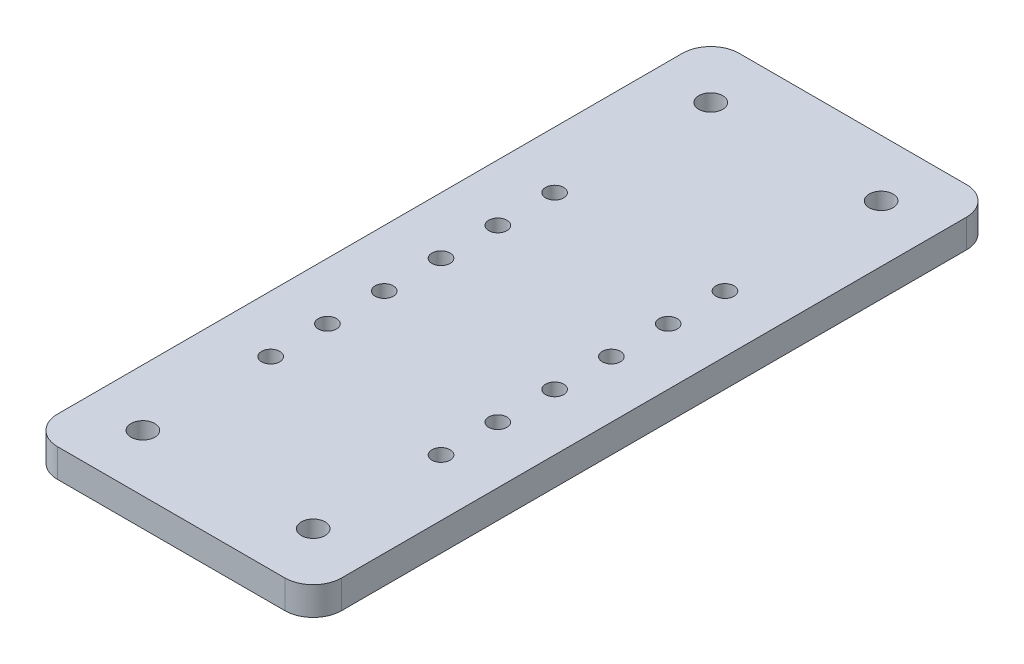
ISO-10303-21;
HEADER;
FILE_DESCRIPTION(('STEP AP214'),'2;1');
FILE_NAME('part.step','',(''),(''),'','','');
FILE_SCHEMA(('AUTOMOTIVE_DESIGN { 1 0 10303 214 1 1 1 1 }'));
ENDSEC;
DATA;
#1=APPLICATION_CONTEXT('core data for automotive mechanical design processes');
#2=APPLICATION_PROTOCOL_DEFINITION('international standard','automotive_design',2000,#1);
#3=PRODUCT_CONTEXT('',#1,'mechanical');
#4=PRODUCT('Part','Part','',(#3));
#5=PRODUCT_RELATED_PRODUCT_CATEGORY('part','',(#4));
#6=PRODUCT_DEFINITION_FORMATION('','',#4);
#7=PRODUCT_DEFINITION_CONTEXT('part definition',#1,'design');
#8=PRODUCT_DEFINITION('design','',#6,#7);
#9=PRODUCT_DEFINITION_SHAPE('','',#8);
#10=(LENGTH_UNIT() NAMED_UNIT(*) SI_UNIT(.MILLI.,.METRE.));
#11=(NAMED_UNIT(*) PLANE_ANGLE_UNIT() SI_UNIT($,.RADIAN.));
#12=(NAMED_UNIT(*) SI_UNIT($,.STERADIAN.) SOLID_ANGLE_UNIT());
#13=UNCERTAINTY_MEASURE_WITH_UNIT(LENGTH_MEASURE(1.E-05),#10,'distance_accuracy_value','');
#14=(GEOMETRIC_REPRESENTATION_CONTEXT(3) GLOBAL_UNCERTAINTY_ASSIGNED_CONTEXT((#13)) GLOBAL_UNIT_ASSIGNED_CONTEXT((#10,
#11,#12)) REPRESENTATION_CONTEXT('',''));
#15=CARTESIAN_POINT('',(0.,0.,0.));
#16=DIRECTION('',(0.,0.,1.));
#17=DIRECTION('',(1.,0.,0.));
#18=AXIS2_PLACEMENT_3D('',#15,#16,#17);
#19=CARTESIAN_POINT('',(25.,5.,0.));
#20=DIRECTION('',(1.,0.,0.));
#21=DIRECTION('',(0.,0.,-1.));
#22=AXIS2_PLACEMENT_3D('',#19,#20,#21);
#23=PLANE('',#22);
#24=DIRECTION('',(0.,0.,1.));
#25=VECTOR('',#24,1.);
#26=CARTESIAN_POINT('',(25.,5.,0.));
#27=LINE('',#26,#25);
#28=CARTESIAN_POINT('',(25.,5.,-55.));
#29=VERTEX_POINT('',#28);
#30=CARTESIAN_POINT('',(25.,5.,55.));
#31=VERTEX_POINT('',#30);
#32=EDGE_CURVE('E237',#29,#31,#27,.T.);
#33=ORIENTED_EDGE('',*,*,#32,.T.);
#34=DIRECTION('',(0.,-1.,0.));
#35=VECTOR('',#34,1.);
#36=CARTESIAN_POINT('',(25.,0.,55.));
#37=LINE('',#36,#35);
#38=CARTESIAN_POINT('',(25.,0.,55.));
#39=VERTEX_POINT('',#38);
#40=EDGE_CURVE('E230',#31,#39,#37,.T.);
#41=ORIENTED_EDGE('',*,*,#40,.T.);
#42=DIRECTION('',(0.,0.,1.));
#43=VECTOR('',#42,1.);
#44=CARTESIAN_POINT('',(25.,0.,0.));
#45=LINE('',#44,#43);
#46=CARTESIAN_POINT('',(25.,0.,-55.));
#47=VERTEX_POINT('',#46);
#48=EDGE_CURVE('E188',#47,#39,#45,.T.);
#49=ORIENTED_EDGE('',*,*,#48,.F.);
#50=DIRECTION('',(0.,-1.,0.));
#51=VECTOR('',#50,1.);
#52=CARTESIAN_POINT('',(25.,5.,-55.));
#53=LINE('',#52,#51);
#54=EDGE_CURVE('E228',#47,#29,#53,.F.);
#55=ORIENTED_EDGE('',*,*,#54,.T.);
#56=EDGE_LOOP('',(#33,#41,#49,#55));
#57=FACE_BOUND('',#56,.T.);
#58=ADVANCED_FACE('F89',(#57),#23,.T.);
#59=CARTESIAN_POINT('',(-25.,5.,0.));
#60=DIRECTION('',(1.,0.,0.));
#61=DIRECTION('',(0.,0.,-1.));
#62=AXIS2_PLACEMENT_3D('',#59,#60,#61);
#63=PLANE('',#62);
#64=DIRECTION('',(0.,0.,1.));
#65=VECTOR('',#64,1.);
#66=CARTESIAN_POINT('',(-25.,0.,0.));
#67=LINE('',#66,#65);
#68=CARTESIAN_POINT('',(-25.,0.,-55.));
#69=VERTEX_POINT('',#68);
#70=CARTESIAN_POINT('',(-25.,0.,55.));
#71=VERTEX_POINT('',#70);
#72=EDGE_CURVE('E183',#69,#71,#67,.T.);
#73=ORIENTED_EDGE('',*,*,#72,.T.);
#74=DIRECTION('',(0.,-1.,0.));
#75=VECTOR('',#74,1.);
#76=CARTESIAN_POINT('',(-25.,5.,55.));
#77=LINE('',#76,#75);
#78=CARTESIAN_POINT('',(-25.,5.,55.));
#79=VERTEX_POINT('',#78);
#80=EDGE_CURVE('E160',#71,#79,#77,.F.);
#81=ORIENTED_EDGE('',*,*,#80,.T.);
#82=DIRECTION('',(0.,0.,1.));
#83=VECTOR('',#82,1.);
#84=CARTESIAN_POINT('',(-25.,5.,0.));
#85=LINE('',#84,#83);
#86=CARTESIAN_POINT('',(-25.,5.,-55.));
#87=VERTEX_POINT('',#86);
#88=EDGE_CURVE('E283',#87,#79,#85,.T.);
#89=ORIENTED_EDGE('',*,*,#88,.F.);
#90=DIRECTION('',(0.,-1.,0.));
#91=VECTOR('',#90,1.);
#92=CARTESIAN_POINT('',(-25.,5.,-55.));
#93=LINE('',#92,#91);
#94=EDGE_CURVE('E165',#87,#69,#93,.T.);
#95=ORIENTED_EDGE('',*,*,#94,.T.);
#96=EDGE_LOOP('',(#73,#81,#89,#95));
#97=FACE_BOUND('',#96,.T.);
#98=ADVANCED_FACE('F401',(#97),#63,.F.);
#99=CARTESIAN_POINT('',(-15.,5.,50.));
#100=DIRECTION('',(0.,-1.,0.));
#101=DIRECTION('',(0.,0.,-1.));
#102=AXIS2_PLACEMENT_3D('',#99,#100,#101);
#103=CYLINDRICAL_SURFACE('',#102,2.1);
#104=CARTESIAN_POINT('',(-15.,5.,50.));
#105=DIRECTION('',(0.,1.,0.));
#106=DIRECTION('',(0.,0.,1.));
#107=AXIS2_PLACEMENT_3D('',#104,#105,#106);
#108=CIRCLE('',#107,2.1);
#109=CARTESIAN_POINT('',(-15.,5.,52.1));
#110=VERTEX_POINT('',#109);
#111=EDGE_CURVE('E279',#110,#110,#108,.T.);
#112=ORIENTED_EDGE('',*,*,#111,.T.);
#113=EDGE_LOOP('',(#112));
#114=FACE_BOUND('',#113,.T.);
#115=CARTESIAN_POINT('',(-15.,0.,50.));
#116=DIRECTION('',(0.,1.,0.));
#117=DIRECTION('',(0.,0.,1.));
#118=AXIS2_PLACEMENT_3D('',#115,#116,#117);
#119=CIRCLE('',#118,2.1);
#120=CARTESIAN_POINT('',(-15.,0.,52.1));
#121=VERTEX_POINT('',#120);
#122=EDGE_CURVE('E182',#121,#121,#119,.T.);
#123=ORIENTED_EDGE('',*,*,#122,.F.);
#124=EDGE_LOOP('',(#123));
#125=FACE_BOUND('',#124,.T.);
#126=ADVANCED_FACE('F403',(#114,#125),#103,.F.);
#127=CARTESIAN_POINT('',(0.,5.,60.));
#128=DIRECTION('',(0.,0.,-1.));
#129=DIRECTION('',(-1.,0.,0.));
#130=AXIS2_PLACEMENT_3D('',#127,#128,#129);
#131=PLANE('',#130);
#132=DIRECTION('',(1.,0.,0.));
#133=VECTOR('',#132,1.);
#134=CARTESIAN_POINT('',(0.,5.,60.));
#135=LINE('',#134,#133);
#136=CARTESIAN_POINT('',(-20.,5.,60.));
#137=VERTEX_POINT('',#136);
#138=CARTESIAN_POINT('',(20.,5.,60.));
#139=VERTEX_POINT('',#138);
#140=EDGE_CURVE('E175',#137,#139,#135,.T.);
#141=ORIENTED_EDGE('',*,*,#140,.F.);
#142=DIRECTION('',(0.,-1.,0.));
#143=VECTOR('',#142,1.);
#144=CARTESIAN_POINT('',(-20.,5.,60.));
#145=LINE('',#144,#143);
#146=CARTESIAN_POINT('',(-20.,0.,60.));
#147=VERTEX_POINT('',#146);
#148=EDGE_CURVE('E159',#137,#147,#145,.T.);
#149=ORIENTED_EDGE('',*,*,#148,.T.);
#150=DIRECTION('',(1.,0.,0.));
#151=VECTOR('',#150,1.);
#152=CARTESIAN_POINT('',(0.,0.,60.));
#153=LINE('',#152,#151);
#154=CARTESIAN_POINT('',(20.,0.,60.));
#155=VERTEX_POINT('',#154);
#156=EDGE_CURVE('E172',#147,#155,#153,.T.);
#157=ORIENTED_EDGE('',*,*,#156,.T.);
#158=DIRECTION('',(0.,-1.,0.));
#159=VECTOR('',#158,1.);
#160=CARTESIAN_POINT('',(20.,5.,60.));
#161=LINE('',#160,#159);
#162=EDGE_CURVE('E177',#155,#139,#161,.F.);
#163=ORIENTED_EDGE('',*,*,#162,.T.);
#164=EDGE_LOOP('',(#141,#149,#157,#163));
#165=FACE_BOUND('',#164,.T.);
#166=ADVANCED_FACE('F171',(#165),#131,.F.);
#167=CARTESIAN_POINT('',(-15.,5.,-22.5));
#168=DIRECTION('',(0.,-1.,0.));
#169=DIRECTION('',(0.,0.,-1.));
#170=AXIS2_PLACEMENT_3D('',#167,#168,#169);
#171=CYLINDRICAL_SURFACE('',#170,1.6);
#172=CARTESIAN_POINT('',(-15.,5.,-22.5));
#173=DIRECTION('',(0.,1.,0.));
#174=DIRECTION('',(0.,0.,1.));
#175=AXIS2_PLACEMENT_3D('',#172,#173,#174);
#176=CIRCLE('',#175,1.6);
#177=CARTESIAN_POINT('',(-15.,5.,-20.9));
#178=VERTEX_POINT('',#177);
#179=EDGE_CURVE('E287',#178,#178,#176,.T.);
#180=ORIENTED_EDGE('',*,*,#179,.T.);
#181=EDGE_LOOP('',(#180));
#182=FACE_BOUND('',#181,.T.);
#183=CARTESIAN_POINT('',(-15.,0.,-22.5));
#184=DIRECTION('',(0.,1.,0.));
#185=DIRECTION('',(0.,0.,1.));
#186=AXIS2_PLACEMENT_3D('',#183,#184,#185);
#187=CIRCLE('',#186,1.6);
#188=CARTESIAN_POINT('',(-15.,0.,-20.9));
#189=VERTEX_POINT('',#188);
#190=EDGE_CURVE('E241',#189,#189,#187,.T.);
#191=ORIENTED_EDGE('',*,*,#190,.F.);
#192=EDGE_LOOP('',(#191));
#193=FACE_BOUND('',#192,.T.);
#194=ADVANCED_FACE('F415',(#182,#193),#171,.F.);
#195=CARTESIAN_POINT('',(15.,5.,-22.5));
#196=DIRECTION('',(0.,-1.,0.));
#197=DIRECTION('',(0.,0.,-1.));
#198=AXIS2_PLACEMENT_3D('',#195,#196,#197);
#199=CYLINDRICAL_SURFACE('',#198,1.6);
#200=CARTESIAN_POINT('',(15.,5.,-22.5));
#201=DIRECTION('',(0.,1.,0.));
#202=DIRECTION('',(0.,0.,1.));
#203=AXIS2_PLACEMENT_3D('',#200,#201,#202);
#204=CIRCLE('',#203,1.6);
#205=CARTESIAN_POINT('',(15.,5.,-20.9));
#206=VERTEX_POINT('',#205);
#207=EDGE_CURVE('E290',#206,#206,#204,.T.);
#208=ORIENTED_EDGE('',*,*,#207,.T.);
#209=EDGE_LOOP('',(#208));
#210=FACE_BOUND('',#209,.T.);
#211=CARTESIAN_POINT('',(15.,0.,-22.5));
#212=DIRECTION('',(0.,1.,0.));
#213=DIRECTION('',(0.,0.,1.));
#214=AXIS2_PLACEMENT_3D('',#211,#212,#213);
#215=CIRCLE('',#214,1.6);
#216=CARTESIAN_POINT('',(15.,0.,-20.9));
#217=VERTEX_POINT('',#216);
#218=EDGE_CURVE('E243',#217,#217,#215,.T.);
#219=ORIENTED_EDGE('',*,*,#218,.F.);
#220=EDGE_LOOP('',(#219));
#221=FACE_BOUND('',#220,.T.);
#222=ADVANCED_FACE('F418',(#210,#221),#199,.F.);
#223=CARTESIAN_POINT('',(-15.,5.,-12.5));
#224=DIRECTION('',(0.,-1.,0.));
#225=DIRECTION('',(0.,0.,-1.));
#226=AXIS2_PLACEMENT_3D('',#223,#224,#225);
#227=CYLINDRICAL_SURFACE('',#226,1.60000000000009);
#228=CARTESIAN_POINT('',(-15.,5.,-12.5));
#229=DIRECTION('',(0.,1.,0.));
#230=DIRECTION('',(0.,0.,1.));
#231=AXIS2_PLACEMENT_3D('',#228,#229,#230);
#232=CIRCLE('',#231,1.60000000000009);
#233=CARTESIAN_POINT('',(-15.,5.,-10.8999999999999));
#234=VERTEX_POINT('',#233);
#235=EDGE_CURVE('E293',#234,#234,#232,.T.);
#236=ORIENTED_EDGE('',*,*,#235,.T.);
#237=EDGE_LOOP('',(#236));
#238=FACE_BOUND('',#237,.T.);
#239=CARTESIAN_POINT('',(-15.,0.,-12.5));
#240=DIRECTION('',(0.,1.,0.));
#241=DIRECTION('',(0.,0.,1.));
#242=AXIS2_PLACEMENT_3D('',#239,#240,#241);
#243=CIRCLE('',#242,1.60000000000009);
#244=CARTESIAN_POINT('',(-15.,0.,-10.8999999999999));
#245=VERTEX_POINT('',#244);
#246=EDGE_CURVE('E248',#245,#245,#243,.T.);
#247=ORIENTED_EDGE('',*,*,#246,.F.);
#248=EDGE_LOOP('',(#247));
#249=FACE_BOUND('',#248,.T.);
#250=ADVANCED_FACE('F422',(#238,#249),#227,.F.);
#251=CARTESIAN_POINT('',(15.0000000000001,5.,-12.5));
#252=DIRECTION('',(0.,-1.,0.));
#253=DIRECTION('',(0.,0.,-1.));
#254=AXIS2_PLACEMENT_3D('',#251,#252,#253);
#255=CYLINDRICAL_SURFACE('',#254,1.6);
#256=CARTESIAN_POINT('',(15.0000000000001,5.,-12.5));
#257=DIRECTION('',(0.,1.,0.));
#258=DIRECTION('',(0.,0.,1.));
#259=AXIS2_PLACEMENT_3D('',#256,#257,#258);
#260=CIRCLE('',#259,1.6);
#261=CARTESIAN_POINT('',(15.0000000000001,5.,-10.9));
#262=VERTEX_POINT('',#261);
#263=EDGE_CURVE('E296',#262,#262,#260,.T.);
#264=ORIENTED_EDGE('',*,*,#263,.T.);
#265=EDGE_LOOP('',(#264));
#266=FACE_BOUND('',#265,.T.);
#267=CARTESIAN_POINT('',(15.0000000000001,0.,-12.5));
#268=DIRECTION('',(0.,1.,0.));
#269=DIRECTION('',(0.,0.,1.));
#270=AXIS2_PLACEMENT_3D('',#267,#268,#269);
#271=CIRCLE('',#270,1.6);
#272=CARTESIAN_POINT('',(15.0000000000001,0.,-10.9));
#273=VERTEX_POINT('',#272);
#274=EDGE_CURVE('E251',#273,#273,#271,.T.);
#275=ORIENTED_EDGE('',*,*,#274,.F.);
#276=EDGE_LOOP('',(#275));
#277=FACE_BOUND('',#276,.T.);
#278=ADVANCED_FACE('F426',(#266,#277),#255,.F.);
#279=CARTESIAN_POINT('',(-14.9999999999998,5.,-2.5));
#280=DIRECTION('',(0.,-1.,0.));
#281=DIRECTION('',(0.,0.,-1.));
#282=AXIS2_PLACEMENT_3D('',#279,#280,#281);
#283=CYLINDRICAL_SURFACE('',#282,1.6);
#284=CARTESIAN_POINT('',(-14.9999999999998,5.,-2.5));
#285=DIRECTION('',(0.,1.,0.));
#286=DIRECTION('',(0.,0.,1.));
#287=AXIS2_PLACEMENT_3D('',#284,#285,#286);
#288=CIRCLE('',#287,1.6);
#289=CARTESIAN_POINT('',(-14.9999999999998,5.,-0.899999999999997));
#290=VERTEX_POINT('',#289);
#291=EDGE_CURVE('E299',#290,#290,#288,.T.);
#292=ORIENTED_EDGE('',*,*,#291,.T.);
#293=EDGE_LOOP('',(#292));
#294=FACE_BOUND('',#293,.T.);
#295=CARTESIAN_POINT('',(-14.9999999999998,0.,-2.5));
#296=DIRECTION('',(0.,1.,0.));
#297=DIRECTION('',(0.,0.,1.));
#298=AXIS2_PLACEMENT_3D('',#295,#296,#297);
#299=CIRCLE('',#298,1.6);
#300=CARTESIAN_POINT('',(-14.9999999999998,0.,-0.899999999999997));
#301=VERTEX_POINT('',#300);
#302=EDGE_CURVE('E254',#301,#301,#299,.T.);
#303=ORIENTED_EDGE('',*,*,#302,.F.);
#304=EDGE_LOOP('',(#303));
#305=FACE_BOUND('',#304,.T.);
#306=ADVANCED_FACE('F430',(#294,#305),#283,.F.);
#307=CARTESIAN_POINT('',(15.0000000000002,5.,-2.5));
#308=DIRECTION('',(0.,-1.,0.));
#309=DIRECTION('',(0.,0.,-1.));
#310=AXIS2_PLACEMENT_3D('',#307,#308,#309);
#311=CYLINDRICAL_SURFACE('',#310,1.6);
#312=CARTESIAN_POINT('',(15.0000000000002,5.,-2.5));
#313=DIRECTION('',(0.,1.,0.));
#314=DIRECTION('',(0.,0.,1.));
#315=AXIS2_PLACEMENT_3D('',#312,#313,#314);
#316=CIRCLE('',#315,1.6);
#317=CARTESIAN_POINT('',(15.0000000000002,5.,-0.899999999999999));
#318=VERTEX_POINT('',#317);
#319=EDGE_CURVE('E302',#318,#318,#316,.T.);
#320=ORIENTED_EDGE('',*,*,#319,.T.);
#321=EDGE_LOOP('',(#320));
#322=FACE_BOUND('',#321,.T.);
#323=CARTESIAN_POINT('',(15.0000000000002,0.,-2.5));
#324=DIRECTION('',(0.,1.,0.));
#325=DIRECTION('',(0.,0.,1.));
#326=AXIS2_PLACEMENT_3D('',#323,#324,#325);
#327=CIRCLE('',#326,1.6);
#328=CARTESIAN_POINT('',(15.0000000000002,0.,-0.899999999999999));
#329=VERTEX_POINT('',#328);
#330=EDGE_CURVE('E257',#329,#329,#327,.T.);
#331=ORIENTED_EDGE('',*,*,#330,.F.);
#332=EDGE_LOOP('',(#331));
#333=FACE_BOUND('',#332,.T.);
#334=ADVANCED_FACE('F434',(#322,#333),#311,.F.);
#335=CARTESIAN_POINT('',(-14.9999999999997,5.,7.5));
#336=DIRECTION('',(0.,-1.,0.));
#337=DIRECTION('',(0.,0.,-1.));
#338=AXIS2_PLACEMENT_3D('',#335,#336,#337);
#339=CYLINDRICAL_SURFACE('',#338,1.6);
#340=CARTESIAN_POINT('',(-14.9999999999997,5.,7.5));
#341=DIRECTION('',(0.,1.,0.));
#342=DIRECTION('',(0.,0.,1.));
#343=AXIS2_PLACEMENT_3D('',#340,#341,#342);
#344=CIRCLE('',#343,1.6);
#345=CARTESIAN_POINT('',(-14.9999999999997,5.,9.1));
#346=VERTEX_POINT('',#345);
#347=EDGE_CURVE('E305',#346,#346,#344,.T.);
#348=ORIENTED_EDGE('',*,*,#347,.T.);
#349=EDGE_LOOP('',(#348));
#350=FACE_BOUND('',#349,.T.);
#351=CARTESIAN_POINT('',(-14.9999999999997,0.,7.5));
#352=DIRECTION('',(0.,1.,0.));
#353=DIRECTION('',(0.,0.,1.));
#354=AXIS2_PLACEMENT_3D('',#351,#352,#353);
#355=CIRCLE('',#354,1.6);
#356=CARTESIAN_POINT('',(-14.9999999999997,0.,9.1));
#357=VERTEX_POINT('',#356);
#358=EDGE_CURVE('E260',#357,#357,#355,.T.);
#359=ORIENTED_EDGE('',*,*,#358,.F.);
#360=EDGE_LOOP('',(#359));
#361=FACE_BOUND('',#360,.T.);
#362=ADVANCED_FACE('F438',(#350,#361),#339,.F.);
#363=CARTESIAN_POINT('',(15.0000000000003,5.,7.5));
#364=DIRECTION('',(0.,-1.,0.));
#365=DIRECTION('',(0.,0.,-1.));
#366=AXIS2_PLACEMENT_3D('',#363,#364,#365);
#367=CYLINDRICAL_SURFACE('',#366,1.6);
#368=CARTESIAN_POINT('',(15.0000000000003,5.,7.5));
#369=DIRECTION('',(0.,1.,0.));
#370=DIRECTION('',(0.,0.,1.));
#371=AXIS2_PLACEMENT_3D('',#368,#369,#370);
#372=CIRCLE('',#371,1.6);
#373=CARTESIAN_POINT('',(15.0000000000003,5.,9.1));
#374=VERTEX_POINT('',#373);
#375=EDGE_CURVE('E308',#374,#374,#372,.T.);
#376=ORIENTED_EDGE('',*,*,#375,.T.);
#377=EDGE_LOOP('',(#376));
#378=FACE_BOUND('',#377,.T.);
#379=CARTESIAN_POINT('',(15.0000000000003,0.,7.5));
#380=DIRECTION('',(0.,1.,0.));
#381=DIRECTION('',(0.,0.,1.));
#382=AXIS2_PLACEMENT_3D('',#379,#380,#381);
#383=CIRCLE('',#382,1.6);
#384=CARTESIAN_POINT('',(15.0000000000003,0.,9.1));
#385=VERTEX_POINT('',#384);
#386=EDGE_CURVE('E263',#385,#385,#383,.T.);
#387=ORIENTED_EDGE('',*,*,#386,.F.);
#388=EDGE_LOOP('',(#387));
#389=FACE_BOUND('',#388,.T.);
#390=ADVANCED_FACE('F442',(#378,#389),#367,.F.);
#391=CARTESIAN_POINT('',(-14.9999999999996,5.,17.5));
#392=DIRECTION('',(0.,-1.,0.));
#393=DIRECTION('',(0.,0.,-1.));
#394=AXIS2_PLACEMENT_3D('',#391,#392,#393);
#395=CYLINDRICAL_SURFACE('',#394,1.6);
#396=CARTESIAN_POINT('',(-14.9999999999996,5.,17.5));
#397=DIRECTION('',(0.,1.,0.));
#398=DIRECTION('',(0.,0.,1.));
#399=AXIS2_PLACEMENT_3D('',#396,#397,#398);
#400=CIRCLE('',#399,1.6);
#401=CARTESIAN_POINT('',(-14.9999999999996,5.,19.1));
#402=VERTEX_POINT('',#401);
#403=EDGE_CURVE('E311',#402,#402,#400,.T.);
#404=ORIENTED_EDGE('',*,*,#403,.T.);
#405=EDGE_LOOP('',(#404));
#406=FACE_BOUND('',#405,.T.);
#407=CARTESIAN_POINT('',(-14.9999999999996,0.,17.5));
#408=DIRECTION('',(0.,1.,0.));
#409=DIRECTION('',(0.,0.,1.));
#410=AXIS2_PLACEMENT_3D('',#407,#408,#409);
#411=CIRCLE('',#410,1.6);
#412=CARTESIAN_POINT('',(-14.9999999999996,0.,19.1));
#413=VERTEX_POINT('',#412);
#414=EDGE_CURVE('E266',#413,#413,#411,.T.);
#415=ORIENTED_EDGE('',*,*,#414,.F.);
#416=EDGE_LOOP('',(#415));
#417=FACE_BOUND('',#416,.T.);
#418=ADVANCED_FACE('F446',(#406,#417),#395,.F.);
#419=CARTESIAN_POINT('',(15.0000000000004,5.,17.5));
#420=DIRECTION('',(0.,-1.,0.));
#421=DIRECTION('',(0.,0.,-1.));
#422=AXIS2_PLACEMENT_3D('',#419,#420,#421);
#423=CYLINDRICAL_SURFACE('',#422,1.6);
#424=CARTESIAN_POINT('',(15.0000000000004,5.,17.5));
#425=DIRECTION('',(0.,1.,0.));
#426=DIRECTION('',(0.,0.,1.));
#427=AXIS2_PLACEMENT_3D('',#424,#425,#426);
#428=CIRCLE('',#427,1.6);
#429=CARTESIAN_POINT('',(15.0000000000004,5.,19.1));
#430=VERTEX_POINT('',#429);
#431=EDGE_CURVE('E314',#430,#430,#428,.T.);
#432=ORIENTED_EDGE('',*,*,#431,.T.);
#433=EDGE_LOOP('',(#432));
#434=FACE_BOUND('',#433,.T.);
#435=CARTESIAN_POINT('',(15.0000000000004,0.,17.5));
#436=DIRECTION('',(0.,1.,0.));
#437=DIRECTION('',(0.,0.,1.));
#438=AXIS2_PLACEMENT_3D('',#435,#436,#437);
#439=CIRCLE('',#438,1.6);
#440=CARTESIAN_POINT('',(15.0000000000004,0.,19.1));
#441=VERTEX_POINT('',#440);
#442=EDGE_CURVE('E269',#441,#441,#439,.T.);
#443=ORIENTED_EDGE('',*,*,#442,.F.);
#444=EDGE_LOOP('',(#443));
#445=FACE_BOUND('',#444,.T.);
#446=ADVANCED_FACE('F450',(#434,#445),#423,.F.);
#447=CARTESIAN_POINT('',(-14.9999999999995,5.,27.5));
#448=DIRECTION('',(0.,-1.,0.));
#449=DIRECTION('',(0.,0.,-1.));
#450=AXIS2_PLACEMENT_3D('',#447,#448,#449);
#451=CYLINDRICAL_SURFACE('',#450,1.6);
#452=CARTESIAN_POINT('',(-14.9999999999995,5.,27.5));
#453=DIRECTION('',(0.,1.,0.));
#454=DIRECTION('',(0.,0.,1.));
#455=AXIS2_PLACEMENT_3D('',#452,#453,#454);
#456=CIRCLE('',#455,1.6);
#457=CARTESIAN_POINT('',(-14.9999999999995,5.,29.1));
#458=VERTEX_POINT('',#457);
#459=EDGE_CURVE('E317',#458,#458,#456,.T.);
#460=ORIENTED_EDGE('',*,*,#459,.T.);
#461=EDGE_LOOP('',(#460));
#462=FACE_BOUND('',#461,.T.);
#463=CARTESIAN_POINT('',(-14.9999999999995,0.,27.5));
#464=DIRECTION('',(0.,1.,0.));
#465=DIRECTION('',(0.,0.,1.));
#466=AXIS2_PLACEMENT_3D('',#463,#464,#465);
#467=CIRCLE('',#466,1.6);
#468=CARTESIAN_POINT('',(-14.9999999999995,0.,29.1));
#469=VERTEX_POINT('',#468);
#470=EDGE_CURVE('E272',#469,#469,#467,.T.);
#471=ORIENTED_EDGE('',*,*,#470,.F.);
#472=EDGE_LOOP('',(#471));
#473=FACE_BOUND('',#472,.T.);
#474=ADVANCED_FACE('F454',(#462,#473),#451,.F.);
#475=CARTESIAN_POINT('',(15.0000000000005,5.,27.5));
#476=DIRECTION('',(0.,-1.,0.));
#477=DIRECTION('',(0.,0.,-1.));
#478=AXIS2_PLACEMENT_3D('',#475,#476,#477);
#479=CYLINDRICAL_SURFACE('',#478,1.6);
#480=CARTESIAN_POINT('',(15.0000000000005,5.,27.5));
#481=DIRECTION('',(0.,1.,0.));
#482=DIRECTION('',(0.,0.,1.));
#483=AXIS2_PLACEMENT_3D('',#480,#481,#482);
#484=CIRCLE('',#483,1.6);
#485=CARTESIAN_POINT('',(15.0000000000005,5.,29.1));
#486=VERTEX_POINT('',#485);
#487=EDGE_CURVE('E194',#486,#486,#484,.T.);
#488=ORIENTED_EDGE('',*,*,#487,.T.);
#489=EDGE_LOOP('',(#488));
#490=FACE_BOUND('',#489,.T.);
#491=CARTESIAN_POINT('',(15.0000000000005,0.,27.5));
#492=DIRECTION('',(0.,1.,0.));
#493=DIRECTION('',(0.,0.,1.));
#494=AXIS2_PLACEMENT_3D('',#491,#492,#493);
#495=CIRCLE('',#494,1.6);
#496=CARTESIAN_POINT('',(15.0000000000005,0.,29.1));
#497=VERTEX_POINT('',#496);
#498=EDGE_CURVE('E210',#497,#497,#495,.T.);
#499=ORIENTED_EDGE('',*,*,#498,.F.);
#500=EDGE_LOOP('',(#499));
#501=FACE_BOUND('',#500,.T.);
#502=ADVANCED_FACE('F323',(#490,#501),#479,.F.);
#503=CARTESIAN_POINT('',(15.,5.,50.));
#504=DIRECTION('',(0.,-1.,0.));
#505=DIRECTION('',(0.,0.,-1.));
#506=AXIS2_PLACEMENT_3D('',#503,#504,#505);
#507=CYLINDRICAL_SURFACE('',#506,2.1);
#508=CARTESIAN_POINT('',(15.,5.,50.));
#509=DIRECTION('',(0.,1.,0.));
#510=DIRECTION('',(0.,0.,1.));
#511=AXIS2_PLACEMENT_3D('',#508,#509,#510);
#512=CIRCLE('',#511,2.1);
#513=CARTESIAN_POINT('',(15.,5.,52.1));
#514=VERTEX_POINT('',#513);
#515=EDGE_CURVE('E212',#514,#514,#512,.F.);
#516=ORIENTED_EDGE('',*,*,#515,.F.);
#517=EDGE_LOOP('',(#516));
#518=FACE_BOUND('',#517,.T.);
#519=CARTESIAN_POINT('',(15.,0.,50.));
#520=DIRECTION('',(0.,1.,0.));
#521=DIRECTION('',(0.,0.,1.));
#522=AXIS2_PLACEMENT_3D('',#519,#520,#521);
#523=CIRCLE('',#522,2.1);
#524=CARTESIAN_POINT('',(15.,0.,52.1));
#525=VERTEX_POINT('',#524);
#526=EDGE_CURVE('E186',#525,#525,#523,.F.);
#527=ORIENTED_EDGE('',*,*,#526,.T.);
#528=EDGE_LOOP('',(#527));
#529=FACE_BOUND('',#528,.T.);
#530=ADVANCED_FACE('F329',(#518,#529),#507,.F.);
#531=CARTESIAN_POINT('',(0.,5.,0.));
#532=DIRECTION('',(0.,1.,0.));
#533=DIRECTION('',(0.,0.,1.));
#534=AXIS2_PLACEMENT_3D('',#531,#532,#533);
#535=PLANE('',#534);
#536=ORIENTED_EDGE('',*,*,#487,.F.);
#537=EDGE_LOOP('',(#536));
#538=FACE_BOUND('',#537,.T.);
#539=ORIENTED_EDGE('',*,*,#459,.F.);
#540=EDGE_LOOP('',(#539));
#541=FACE_BOUND('',#540,.T.);
#542=ORIENTED_EDGE('',*,*,#431,.F.);
#543=EDGE_LOOP('',(#542));
#544=FACE_BOUND('',#543,.T.);
#545=ORIENTED_EDGE('',*,*,#403,.F.);
#546=EDGE_LOOP('',(#545));
#547=FACE_BOUND('',#546,.T.);
#548=ORIENTED_EDGE('',*,*,#375,.F.);
#549=EDGE_LOOP('',(#548));
#550=FACE_BOUND('',#549,.T.);
#551=ORIENTED_EDGE('',*,*,#347,.F.);
#552=EDGE_LOOP('',(#551));
#553=FACE_BOUND('',#552,.T.);
#554=ORIENTED_EDGE('',*,*,#319,.F.);
#555=EDGE_LOOP('',(#554));
#556=FACE_BOUND('',#555,.T.);
#557=ORIENTED_EDGE('',*,*,#291,.F.);
#558=EDGE_LOOP('',(#557));
#559=FACE_BOUND('',#558,.T.);
#560=ORIENTED_EDGE('',*,*,#263,.F.);
#561=EDGE_LOOP('',(#560));
#562=FACE_BOUND('',#561,.T.);
#563=ORIENTED_EDGE('',*,*,#235,.F.);
#564=EDGE_LOOP('',(#563));
#565=FACE_BOUND('',#564,.T.);
#566=ORIENTED_EDGE('',*,*,#207,.F.);
#567=EDGE_LOOP('',(#566));
#568=FACE_BOUND('',#567,.T.);
#569=ORIENTED_EDGE('',*,*,#179,.F.);
#570=EDGE_LOOP('',(#569));
#571=FACE_BOUND('',#570,.T.);
#572=ORIENTED_EDGE('',*,*,#88,.T.);
#573=CARTESIAN_POINT('',(-20.,5.,55.));
#574=DIRECTION('',(0.,1.,0.));
#575=DIRECTION('',(0.,0.,1.));
#576=AXIS2_PLACEMENT_3D('',#573,#574,#575);
#577=CIRCLE('',#576,5.);
#578=EDGE_CURVE('E226',#79,#137,#577,.T.);
#579=ORIENTED_EDGE('',*,*,#578,.T.);
#580=ORIENTED_EDGE('',*,*,#140,.T.);
#581=CARTESIAN_POINT('',(20.,5.,55.));
#582=DIRECTION('',(0.,1.,0.));
#583=DIRECTION('',(0.,0.,1.));
#584=AXIS2_PLACEMENT_3D('',#581,#582,#583);
#585=CIRCLE('',#584,5.);
#586=EDGE_CURVE('E224',#139,#31,#585,.T.);
#587=ORIENTED_EDGE('',*,*,#586,.T.);
#588=ORIENTED_EDGE('',*,*,#32,.F.);
#589=CARTESIAN_POINT('',(20.,5.,-55.));
#590=DIRECTION('',(0.,1.,0.));
#591=DIRECTION('',(0.,0.,1.));
#592=AXIS2_PLACEMENT_3D('',#589,#590,#591);
#593=CIRCLE('',#592,5.);
#594=CARTESIAN_POINT('',(20.,5.,-60.));
#595=VERTEX_POINT('',#594);
#596=EDGE_CURVE('E110',#29,#595,#593,.T.);
#597=ORIENTED_EDGE('',*,*,#596,.T.);
#598=DIRECTION('',(-1.,0.,0.));
#599=VECTOR('',#598,1.);
#600=CARTESIAN_POINT('',(25.,5.,-60.));
#601=LINE('',#600,#599);
#602=CARTESIAN_POINT('',(-20.,5.,-60.));
#603=VERTEX_POINT('',#602);
#604=EDGE_CURVE('E208',#595,#603,#601,.T.);
#605=ORIENTED_EDGE('',*,*,#604,.T.);
#606=CARTESIAN_POINT('',(-20.,5.,-55.));
#607=DIRECTION('',(0.,1.,0.));
#608=DIRECTION('',(0.,0.,1.));
#609=AXIS2_PLACEMENT_3D('',#606,#607,#608);
#610=CIRCLE('',#609,5.);
#611=EDGE_CURVE('E221',#603,#87,#610,.T.);
#612=ORIENTED_EDGE('',*,*,#611,.T.);
#613=EDGE_LOOP('',(#572,#579,#580,#587,#588,#597,#605,#612));
#614=FACE_BOUND('',#613,.T.);
#615=ORIENTED_EDGE('',*,*,#111,.F.);
#616=EDGE_LOOP('',(#615));
#617=FACE_BOUND('',#616,.T.);
#618=ORIENTED_EDGE('',*,*,#515,.T.);
#619=EDGE_LOOP('',(#618));
#620=FACE_BOUND('',#619,.T.);
#621=CARTESIAN_POINT('',(-15.,5.,-50.));
#622=DIRECTION('',(0.,-1.,0.));
#623=DIRECTION('',(0.,0.,-1.));
#624=AXIS2_PLACEMENT_3D('',#621,#622,#623);
#625=CIRCLE('',#624,2.1);
#626=CARTESIAN_POINT('',(-15.,5.,-52.1));
#627=VERTEX_POINT('',#626);
#628=EDGE_CURVE('E195',#627,#627,#625,.T.);
#629=ORIENTED_EDGE('',*,*,#628,.T.);
#630=EDGE_LOOP('',(#629));
#631=FACE_BOUND('',#630,.T.);
#632=CARTESIAN_POINT('',(15.,5.,-50.));
#633=DIRECTION('',(0.,1.,0.));
#634=DIRECTION('',(0.,0.,1.));
#635=AXIS2_PLACEMENT_3D('',#632,#633,#634);
#636=CIRCLE('',#635,2.1);
#637=CARTESIAN_POINT('',(15.,5.,-47.9));
#638=VERTEX_POINT('',#637);
#639=EDGE_CURVE('E202',#638,#638,#636,.T.);
#640=ORIENTED_EDGE('',*,*,#639,.F.);
#641=EDGE_LOOP('',(#640));
#642=FACE_BOUND('',#641,.T.);
#643=ADVANCED_FACE('F326',(#538,#541,#544,#547,#550,#553,#556,#559,#562,#565,#568,#571,#614,
#617,#620,#631,#642),#535,.T.);
#644=CARTESIAN_POINT('',(0.,0.,0.));
#645=DIRECTION('',(0.,1.,0.));
#646=DIRECTION('',(0.,0.,1.));
#647=AXIS2_PLACEMENT_3D('',#644,#645,#646);
#648=PLANE('',#647);
#649=ORIENTED_EDGE('',*,*,#498,.T.);
#650=EDGE_LOOP('',(#649));
#651=FACE_BOUND('',#650,.T.);
#652=ORIENTED_EDGE('',*,*,#470,.T.);
#653=EDGE_LOOP('',(#652));
#654=FACE_BOUND('',#653,.T.);
#655=ORIENTED_EDGE('',*,*,#442,.T.);
#656=EDGE_LOOP('',(#655));
#657=FACE_BOUND('',#656,.T.);
#658=ORIENTED_EDGE('',*,*,#414,.T.);
#659=EDGE_LOOP('',(#658));
#660=FACE_BOUND('',#659,.T.);
#661=ORIENTED_EDGE('',*,*,#386,.T.);
#662=EDGE_LOOP('',(#661));
#663=FACE_BOUND('',#662,.T.);
#664=ORIENTED_EDGE('',*,*,#358,.T.);
#665=EDGE_LOOP('',(#664));
#666=FACE_BOUND('',#665,.T.);
#667=ORIENTED_EDGE('',*,*,#330,.T.);
#668=EDGE_LOOP('',(#667));
#669=FACE_BOUND('',#668,.T.);
#670=ORIENTED_EDGE('',*,*,#302,.T.);
#671=EDGE_LOOP('',(#670));
#672=FACE_BOUND('',#671,.T.);
#673=ORIENTED_EDGE('',*,*,#274,.T.);
#674=EDGE_LOOP('',(#673));
#675=FACE_BOUND('',#674,.T.);
#676=ORIENTED_EDGE('',*,*,#246,.T.);
#677=EDGE_LOOP('',(#676));
#678=FACE_BOUND('',#677,.T.);
#679=ORIENTED_EDGE('',*,*,#218,.T.);
#680=EDGE_LOOP('',(#679));
#681=FACE_BOUND('',#680,.T.);
#682=ORIENTED_EDGE('',*,*,#190,.T.);
#683=EDGE_LOOP('',(#682));
#684=FACE_BOUND('',#683,.T.);
#685=ORIENTED_EDGE('',*,*,#156,.F.);
#686=CARTESIAN_POINT('',(-20.,0.,55.));
#687=DIRECTION('',(0.,1.,0.));
#688=DIRECTION('',(0.,0.,1.));
#689=AXIS2_PLACEMENT_3D('',#686,#687,#688);
#690=CIRCLE('',#689,5.);
#691=EDGE_CURVE('E155',#147,#71,#690,.F.);
#692=ORIENTED_EDGE('',*,*,#691,.T.);
#693=ORIENTED_EDGE('',*,*,#72,.F.);
#694=CARTESIAN_POINT('',(-20.,0.,-55.));
#695=DIRECTION('',(0.,1.,0.));
#696=DIRECTION('',(0.,0.,1.));
#697=AXIS2_PLACEMENT_3D('',#694,#695,#696);
#698=CIRCLE('',#697,5.);
#699=CARTESIAN_POINT('',(-20.,0.,-60.));
#700=VERTEX_POINT('',#699);
#701=EDGE_CURVE('E176',#69,#700,#698,.F.);
#702=ORIENTED_EDGE('',*,*,#701,.T.);
#703=DIRECTION('',(-1.,0.,0.));
#704=VECTOR('',#703,1.);
#705=CARTESIAN_POINT('',(25.,0.,-60.));
#706=LINE('',#705,#704);
#707=CARTESIAN_POINT('',(20.,0.,-60.));
#708=VERTEX_POINT('',#707);
#709=EDGE_CURVE('E205',#708,#700,#706,.T.);
#710=ORIENTED_EDGE('',*,*,#709,.F.);
#711=CARTESIAN_POINT('',(20.,0.,-55.));
#712=DIRECTION('',(0.,1.,0.));
#713=DIRECTION('',(0.,0.,1.));
#714=AXIS2_PLACEMENT_3D('',#711,#712,#713);
#715=CIRCLE('',#714,5.);
#716=EDGE_CURVE('E215',#708,#47,#715,.F.);
#717=ORIENTED_EDGE('',*,*,#716,.T.);
#718=ORIENTED_EDGE('',*,*,#48,.T.);
#719=CARTESIAN_POINT('',(20.,0.,55.));
#720=DIRECTION('',(0.,1.,0.));
#721=DIRECTION('',(0.,0.,1.));
#722=AXIS2_PLACEMENT_3D('',#719,#720,#721);
#723=CIRCLE('',#722,5.);
#724=EDGE_CURVE('E166',#39,#155,#723,.F.);
#725=ORIENTED_EDGE('',*,*,#724,.T.);
#726=EDGE_LOOP('',(#685,#692,#693,#702,#710,#717,#718,#725));
#727=FACE_BOUND('',#726,.T.);
#728=ORIENTED_EDGE('',*,*,#122,.T.);
#729=EDGE_LOOP('',(#728));
#730=FACE_BOUND('',#729,.T.);
#731=ORIENTED_EDGE('',*,*,#526,.F.);
#732=EDGE_LOOP('',(#731));
#733=FACE_BOUND('',#732,.T.);
#734=CARTESIAN_POINT('',(-15.,0.,-50.));
#735=DIRECTION('',(0.,-1.,0.));
#736=DIRECTION('',(0.,0.,-1.));
#737=AXIS2_PLACEMENT_3D('',#734,#735,#736);
#738=CIRCLE('',#737,2.1);
#739=CARTESIAN_POINT('',(-15.,0.,-52.1));
#740=VERTEX_POINT('',#739);
#741=EDGE_CURVE('E199',#740,#740,#738,.T.);
#742=ORIENTED_EDGE('',*,*,#741,.F.);
#743=EDGE_LOOP('',(#742));
#744=FACE_BOUND('',#743,.T.);
#745=CARTESIAN_POINT('',(15.,0.,-50.));
#746=DIRECTION('',(0.,1.,0.));
#747=DIRECTION('',(0.,0.,1.));
#748=AXIS2_PLACEMENT_3D('',#745,#746,#747);
#749=CIRCLE('',#748,2.1);
#750=CARTESIAN_POINT('',(15.,0.,-47.9));
#751=VERTEX_POINT('',#750);
#752=EDGE_CURVE('E198',#751,#751,#749,.T.);
#753=ORIENTED_EDGE('',*,*,#752,.T.);
#754=EDGE_LOOP('',(#753));
#755=FACE_BOUND('',#754,.T.);
#756=ADVANCED_FACE('F179',(#651,#654,#657,#660,#663,#666,#669,#672,#675,#678,#681,#684,#727,
#730,#733,#744,#755),#648,.F.);
#757=CARTESIAN_POINT('',(15.,5.,-50.));
#758=DIRECTION('',(0.,-1.,0.));
#759=DIRECTION('',(0.,0.,-1.));
#760=AXIS2_PLACEMENT_3D('',#757,#758,#759);
#761=CYLINDRICAL_SURFACE('',#760,2.1);
#762=ORIENTED_EDGE('',*,*,#639,.T.);
#763=EDGE_LOOP('',(#762));
#764=FACE_BOUND('',#763,.T.);
#765=ORIENTED_EDGE('',*,*,#752,.F.);
#766=EDGE_LOOP('',(#765));
#767=FACE_BOUND('',#766,.T.);
#768=ADVANCED_FACE('F362',(#764,#767),#761,.F.);
#769=CARTESIAN_POINT('',(-15.,5.,-50.));
#770=DIRECTION('',(0.,-1.,0.));
#771=DIRECTION('',(0.,0.,-1.));
#772=AXIS2_PLACEMENT_3D('',#769,#770,#771);
#773=CYLINDRICAL_SURFACE('',#772,2.1);
#774=ORIENTED_EDGE('',*,*,#628,.F.);
#775=EDGE_LOOP('',(#774));
#776=FACE_BOUND('',#775,.T.);
#777=ORIENTED_EDGE('',*,*,#741,.T.);
#778=EDGE_LOOP('',(#777));
#779=FACE_BOUND('',#778,.T.);
#780=ADVANCED_FACE('F365',(#776,#779),#773,.F.);
#781=CARTESIAN_POINT('',(25.,5.,-60.));
#782=DIRECTION('',(0.,0.,1.));
#783=DIRECTION('',(1.,0.,0.));
#784=AXIS2_PLACEMENT_3D('',#781,#782,#783);
#785=PLANE('',#784);
#786=ORIENTED_EDGE('',*,*,#604,.F.);
#787=DIRECTION('',(0.,-1.,0.));
#788=VECTOR('',#787,1.);
#789=CARTESIAN_POINT('',(20.,0.,-60.));
#790=LINE('',#789,#788);
#791=EDGE_CURVE('E12',#595,#708,#790,.T.);
#792=ORIENTED_EDGE('',*,*,#791,.T.);
#793=ORIENTED_EDGE('',*,*,#709,.T.);
#794=DIRECTION('',(0.,-1.,0.));
#795=VECTOR('',#794,1.);
#796=CARTESIAN_POINT('',(-20.,5.,-60.));
#797=LINE('',#796,#795);
#798=EDGE_CURVE('E97',#700,#603,#797,.F.);
#799=ORIENTED_EDGE('',*,*,#798,.T.);
#800=EDGE_LOOP('',(#786,#792,#793,#799));
#801=FACE_BOUND('',#800,.T.);
#802=ADVANCED_FACE('F367',(#801),#785,.F.);
#803=CARTESIAN_POINT('',(-20.,5.,55.));
#804=DIRECTION('',(0.,-1.,0.));
#805=DIRECTION('',(0.,0.,-1.));
#806=AXIS2_PLACEMENT_3D('',#803,#804,#805);
#807=CYLINDRICAL_SURFACE('',#806,5.);
#808=ORIENTED_EDGE('',*,*,#578,.F.);
#809=ORIENTED_EDGE('',*,*,#80,.F.);
#810=ORIENTED_EDGE('',*,*,#691,.F.);
#811=ORIENTED_EDGE('',*,*,#148,.F.);
#812=EDGE_LOOP('',(#808,#809,#810,#811));
#813=FACE_BOUND('',#812,.T.);
#814=ADVANCED_FACE('F158',(#813),#807,.T.);
#815=CARTESIAN_POINT('',(20.,5.,55.));
#816=DIRECTION('',(0.,1.,0.));
#817=DIRECTION('',(0.,0.,1.));
#818=AXIS2_PLACEMENT_3D('',#815,#816,#817);
#819=CYLINDRICAL_SURFACE('',#818,5.);
#820=ORIENTED_EDGE('',*,*,#586,.F.);
#821=ORIENTED_EDGE('',*,*,#162,.F.);
#822=ORIENTED_EDGE('',*,*,#724,.F.);
#823=ORIENTED_EDGE('',*,*,#40,.F.);
#824=EDGE_LOOP('',(#820,#821,#822,#823));
#825=FACE_BOUND('',#824,.T.);
#826=ADVANCED_FACE('F379',(#825),#819,.T.);
#827=CARTESIAN_POINT('',(20.,5.,-55.));
#828=DIRECTION('',(0.,1.,0.));
#829=DIRECTION('',(0.,0.,1.));
#830=AXIS2_PLACEMENT_3D('',#827,#828,#829);
#831=CYLINDRICAL_SURFACE('',#830,5.);
#832=ORIENTED_EDGE('',*,*,#596,.F.);
#833=ORIENTED_EDGE('',*,*,#54,.F.);
#834=ORIENTED_EDGE('',*,*,#716,.F.);
#835=ORIENTED_EDGE('',*,*,#791,.F.);
#836=EDGE_LOOP('',(#832,#833,#834,#835));
#837=FACE_BOUND('',#836,.T.);
#838=ADVANCED_FACE('F390',(#837),#831,.T.);
#839=CARTESIAN_POINT('',(-20.,5.,-55.));
#840=DIRECTION('',(0.,-1.,0.));
#841=DIRECTION('',(0.,0.,-1.));
#842=AXIS2_PLACEMENT_3D('',#839,#840,#841);
#843=CYLINDRICAL_SURFACE('',#842,5.);
#844=ORIENTED_EDGE('',*,*,#611,.F.);
#845=ORIENTED_EDGE('',*,*,#798,.F.);
#846=ORIENTED_EDGE('',*,*,#701,.F.);
#847=ORIENTED_EDGE('',*,*,#94,.F.);
#848=EDGE_LOOP('',(#844,#845,#846,#847));
#849=FACE_BOUND('',#848,.T.);
#850=ADVANCED_FACE('F91',(#849),#843,.T.);
#851=CLOSED_SHELL('',(#58,#98,#126,#166,#194,#222,#250,#278,#306,#334,#362,#390,#418,#446,#474,
#502,#530,#643,#756,#768,#780,#802,#814,#826,#838,#850));
#852=MANIFOLD_SOLID_BREP('B2',#851);
#853=ADVANCED_BREP_SHAPE_REPRESENTATION('',(#18,#852),#14);
#854=SHAPE_DEFINITION_REPRESENTATION(#9,#853);
ENDSEC;
END-ISO-10303-21;
